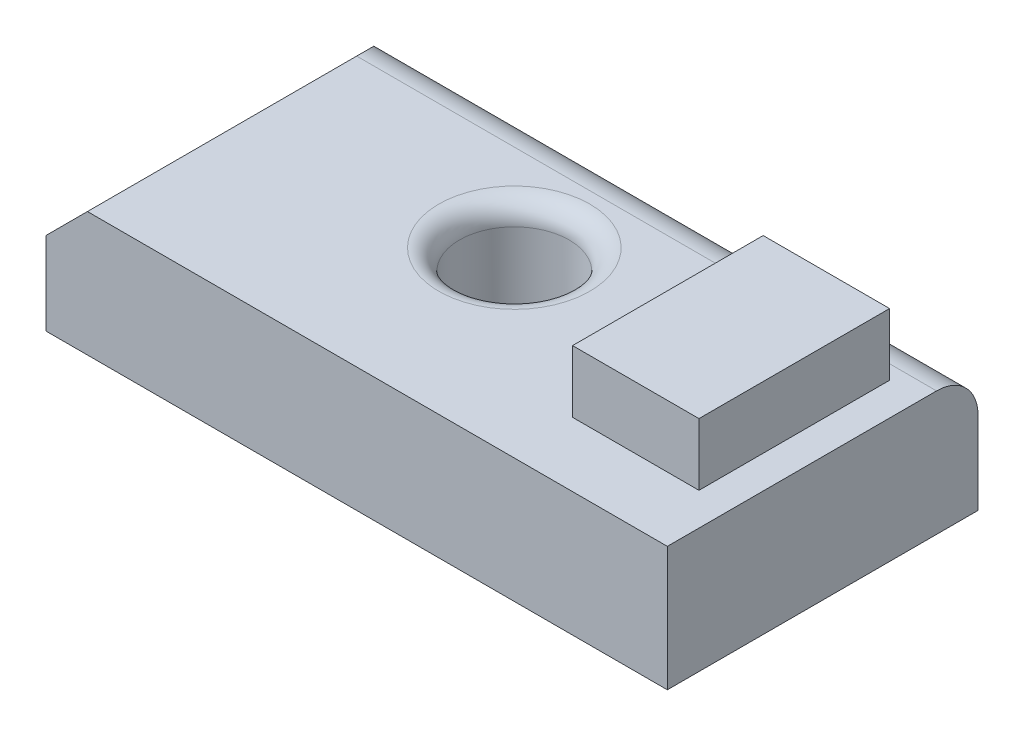
ISO-10303-21;
HEADER;
FILE_DESCRIPTION(('STEP AP214'),'2;1');
FILE_NAME('part.step','',(''),(''),'','','');
FILE_SCHEMA(('AUTOMOTIVE_DESIGN { 1 0 10303 214 1 1 1 1 }'));
ENDSEC;
DATA;
#1=APPLICATION_CONTEXT('core data for automotive mechanical design processes');
#2=APPLICATION_PROTOCOL_DEFINITION('international standard','automotive_design',2000,#1);
#3=PRODUCT_CONTEXT('',#1,'mechanical');
#4=PRODUCT('Part','Part','',(#3));
#5=PRODUCT_RELATED_PRODUCT_CATEGORY('part','',(#4));
#6=PRODUCT_DEFINITION_FORMATION('','',#4);
#7=PRODUCT_DEFINITION_CONTEXT('part definition',#1,'design');
#8=PRODUCT_DEFINITION('design','',#6,#7);
#9=PRODUCT_DEFINITION_SHAPE('','',#8);
#10=(LENGTH_UNIT() NAMED_UNIT(*) SI_UNIT(.MILLI.,.METRE.));
#11=(NAMED_UNIT(*) PLANE_ANGLE_UNIT() SI_UNIT($,.RADIAN.));
#12=(NAMED_UNIT(*) SI_UNIT($,.STERADIAN.) SOLID_ANGLE_UNIT());
#13=UNCERTAINTY_MEASURE_WITH_UNIT(LENGTH_MEASURE(1.E-05),#10,'distance_accuracy_value','');
#14=(GEOMETRIC_REPRESENTATION_CONTEXT(3) GLOBAL_UNCERTAINTY_ASSIGNED_CONTEXT((#13)) GLOBAL_UNIT_ASSIGNED_CONTEXT((#10,
#11,#12)) REPRESENTATION_CONTEXT('',''));
#15=CARTESIAN_POINT('',(0.,0.,0.));
#16=DIRECTION('',(0.,0.,1.));
#17=DIRECTION('',(1.,0.,0.));
#18=AXIS2_PLACEMENT_3D('',#15,#16,#17);
#19=CARTESIAN_POINT('',(0.,762.,0.));
#20=DIRECTION('',(0.,-1.,0.));
#21=DIRECTION('',(0.,0.,-1.));
#22=AXIS2_PLACEMENT_3D('',#19,#20,#21);
#23=PLANE('',#22);
#24=CARTESIAN_POINT('',(1412.46673219988,762.,-339.940416014676));
#25=DIRECTION('',(0.,-1.,0.));
#26=DIRECTION('',(0.,0.,-1.));
#27=AXIS2_PLACEMENT_3D('',#24,#25,#26);
#28=CIRCLE('',#27,463.258211587935);
#29=CARTESIAN_POINT('',(1412.46673219988,762.,-803.198627602611));
#30=VERTEX_POINT('',#29);
#31=EDGE_CURVE('E200',#30,#30,#28,.T.);
#32=ORIENTED_EDGE('',*,*,#31,.T.);
#33=EDGE_LOOP('',(#32));
#34=FACE_BOUND('',#33,.T.);
#35=DIRECTION('',(1.,0.,0.));
#36=VECTOR('',#35,1.);
#37=CARTESIAN_POINT('',(-88.3732718894001,762.,-874.076036866359));
#38=LINE('',#37,#36);
#39=CARTESIAN_POINT('',(3467.6267281106,762.,-874.076036866359));
#40=VERTEX_POINT('',#39);
#41=CARTESIAN_POINT('',(-88.3732718894005,762.,-874.076036866359));
#42=VERTEX_POINT('',#41);
#43=EDGE_CURVE('E221',#40,#42,#38,.F.);
#44=ORIENTED_EDGE('',*,*,#43,.T.);
#45=DIRECTION('',(0.,0.,1.));
#46=VECTOR('',#45,1.);
#47=CARTESIAN_POINT('',(-88.3732718894003,762.,0.));
#48=LINE('',#47,#46);
#49=CARTESIAN_POINT('',(-88.3732718894002,762.,776.923963133641));
#50=VERTEX_POINT('',#49);
#51=EDGE_CURVE('E228',#42,#50,#48,.T.);
#52=ORIENTED_EDGE('',*,*,#51,.T.);
#53=DIRECTION('',(1.,0.,0.));
#54=VECTOR('',#53,1.);
#55=CARTESIAN_POINT('',(-342.373271889401,762.,776.923963133641));
#56=LINE('',#55,#54);
#57=CARTESIAN_POINT('',(3467.6267281106,762.,776.923963133641));
#58=VERTEX_POINT('',#57);
#59=EDGE_CURVE('E165',#50,#58,#56,.T.);
#60=ORIENTED_EDGE('',*,*,#59,.T.);
#61=DIRECTION('',(0.,0.,1.));
#62=VECTOR('',#61,1.);
#63=CARTESIAN_POINT('',(3467.6267281106,762.,-1128.07603686636));
#64=LINE('',#63,#62);
#65=EDGE_CURVE('E168',#40,#58,#64,.T.);
#66=ORIENTED_EDGE('',*,*,#65,.F.);
#67=EDGE_LOOP('',(#44,#52,#60,#66));
#68=FACE_BOUND('',#67,.T.);
#69=DIRECTION('',(0.,0.,1.));
#70=VECTOR('',#69,1.);
#71=CARTESIAN_POINT('',(2491.99555228911,762.,-786.362098171456));
#72=LINE('',#71,#70);
#73=CARTESIAN_POINT('',(2491.99555228911,762.,-786.362098171456));
#74=VERTEX_POINT('',#73);
#75=CARTESIAN_POINT('',(2491.99555228911,762.,382.451095555233));
#76=VERTEX_POINT('',#75);
#77=EDGE_CURVE('E152',#74,#76,#72,.T.);
#78=ORIENTED_EDGE('',*,*,#77,.F.);
#79=DIRECTION('',(-1.,0.,0.));
#80=VECTOR('',#79,1.);
#81=CARTESIAN_POINT('',(2491.99555228911,762.,-786.362098171456));
#82=LINE('',#81,#80);
#83=CARTESIAN_POINT('',(3267.14596896202,762.,-786.362098171456));
#84=VERTEX_POINT('',#83);
#85=EDGE_CURVE('E149',#84,#74,#82,.T.);
#86=ORIENTED_EDGE('',*,*,#85,.F.);
#87=DIRECTION('',(0.,0.,-1.));
#88=VECTOR('',#87,1.);
#89=CARTESIAN_POINT('',(3267.14596896202,762.,-786.362098171456));
#90=LINE('',#89,#88);
#91=CARTESIAN_POINT('',(3267.14596896202,762.,382.451095555233));
#92=VERTEX_POINT('',#91);
#93=EDGE_CURVE('E409',#92,#84,#90,.T.);
#94=ORIENTED_EDGE('',*,*,#93,.F.);
#95=DIRECTION('',(1.,0.,0.));
#96=VECTOR('',#95,1.);
#97=CARTESIAN_POINT('',(2491.99555228911,762.,382.451095555233));
#98=LINE('',#97,#96);
#99=EDGE_CURVE('E419',#76,#92,#98,.T.);
#100=ORIENTED_EDGE('',*,*,#99,.F.);
#101=EDGE_LOOP('',(#78,#86,#94,#100));
#102=FACE_BOUND('',#101,.T.);
#103=ADVANCED_FACE('F42',(#34,#68,#102),#23,.F.);
#104=CARTESIAN_POINT('',(-342.373271889401,762.,776.923963133641));
#105=DIRECTION('',(0.,0.,-1.));
#106=DIRECTION('',(-1.,0.,0.));
#107=AXIS2_PLACEMENT_3D('',#104,#105,#106);
#108=PLANE('',#107);
#109=ORIENTED_EDGE('',*,*,#59,.F.);
#110=DIRECTION('',(0.707106781186546,0.707106781186549,0.));
#111=VECTOR('',#110,1.);
#112=CARTESIAN_POINT('',(-88.3732718894003,762.,776.923963133641));
#113=LINE('',#112,#111);
#114=CARTESIAN_POINT('',(-342.373271889401,507.999999999999,776.923963133641));
#115=VERTEX_POINT('',#114);
#116=EDGE_CURVE('E232',#50,#115,#113,.F.);
#117=ORIENTED_EDGE('',*,*,#116,.T.);
#118=DIRECTION('',(0.,-1.,0.));
#119=VECTOR('',#118,1.);
#120=CARTESIAN_POINT('',(-342.373271889401,762.,776.923963133641));
#121=LINE('',#120,#119);
#122=CARTESIAN_POINT('',(-342.373271889401,0.,776.923963133641));
#123=VERTEX_POINT('',#122);
#124=EDGE_CURVE('E173',#115,#123,#121,.T.);
#125=ORIENTED_EDGE('',*,*,#124,.T.);
#126=DIRECTION('',(1.,0.,0.));
#127=VECTOR('',#126,1.);
#128=CARTESIAN_POINT('',(-342.373271889401,0.,776.923963133641));
#129=LINE('',#128,#127);
#130=CARTESIAN_POINT('',(3467.6267281106,0.,776.923963133641));
#131=VERTEX_POINT('',#130);
#132=EDGE_CURVE('E159',#123,#131,#129,.T.);
#133=ORIENTED_EDGE('',*,*,#132,.T.);
#134=DIRECTION('',(0.,-1.,0.));
#135=VECTOR('',#134,1.);
#136=CARTESIAN_POINT('',(3467.6267281106,762.,776.923963133641));
#137=LINE('',#136,#135);
#138=EDGE_CURVE('E193',#58,#131,#137,.T.);
#139=ORIENTED_EDGE('',*,*,#138,.F.);
#140=EDGE_LOOP('',(#109,#117,#125,#133,#139));
#141=FACE_BOUND('',#140,.T.);
#142=ADVANCED_FACE('F239',(#141),#108,.F.);
#143=CARTESIAN_POINT('',(3467.6267281106,762.,-1128.07603686636));
#144=DIRECTION('',(1.,0.,0.));
#145=DIRECTION('',(0.,0.,-1.));
#146=AXIS2_PLACEMENT_3D('',#143,#144,#145);
#147=PLANE('',#146);
#148=DIRECTION('',(0.,-1.,0.));
#149=VECTOR('',#148,1.);
#150=CARTESIAN_POINT('',(3467.6267281106,762.,-1128.07603686636));
#151=LINE('',#150,#149);
#152=CARTESIAN_POINT('',(3467.6267281106,508.,-1128.07603686636));
#153=VERTEX_POINT('',#152);
#154=CARTESIAN_POINT('',(3467.6267281106,0.,-1128.07603686636));
#155=VERTEX_POINT('',#154);
#156=EDGE_CURVE('E190',#153,#155,#151,.T.);
#157=ORIENTED_EDGE('',*,*,#156,.F.);
#158=CARTESIAN_POINT('',(3467.6267281106,508.,-874.076036866359));
#159=DIRECTION('',(1.,0.,0.));
#160=DIRECTION('',(0.,0.,-1.));
#161=AXIS2_PLACEMENT_3D('',#158,#159,#160);
#162=CIRCLE('',#161,254.);
#163=EDGE_CURVE('E218',#153,#40,#162,.T.);
#164=ORIENTED_EDGE('',*,*,#163,.T.);
#165=ORIENTED_EDGE('',*,*,#65,.T.);
#166=ORIENTED_EDGE('',*,*,#138,.T.);
#167=DIRECTION('',(0.,0.,1.));
#168=VECTOR('',#167,1.);
#169=CARTESIAN_POINT('',(3467.6267281106,0.,-1128.07603686636));
#170=LINE('',#169,#168);
#171=EDGE_CURVE('E177',#155,#131,#170,.T.);
#172=ORIENTED_EDGE('',*,*,#171,.F.);
#173=EDGE_LOOP('',(#157,#164,#165,#166,#172));
#174=FACE_BOUND('',#173,.T.);
#175=ADVANCED_FACE('F256',(#174),#147,.T.);
#176=CARTESIAN_POINT('',(-342.373271889401,762.,-1128.07603686636));
#177=DIRECTION('',(0.,0.,-1.));
#178=DIRECTION('',(-1.,0.,0.));
#179=AXIS2_PLACEMENT_3D('',#176,#177,#178);
#180=PLANE('',#179);
#181=DIRECTION('',(0.,1.,0.));
#182=VECTOR('',#181,1.);
#183=CARTESIAN_POINT('',(-88.3732718894,762.,-1128.07603686636));
#184=LINE('',#183,#182);
#185=CARTESIAN_POINT('',(-88.3732718894001,0.,-1128.07603686636));
#186=VERTEX_POINT('',#185);
#187=CARTESIAN_POINT('',(-88.3732718894,508.,-1128.07603686636));
#188=VERTEX_POINT('',#187);
#189=EDGE_CURVE('E210',#186,#188,#184,.T.);
#190=ORIENTED_EDGE('',*,*,#189,.T.);
#191=DIRECTION('',(1.,0.,0.));
#192=VECTOR('',#191,1.);
#193=CARTESIAN_POINT('',(3467.6267281106,508.,-1128.07603686636));
#194=LINE('',#193,#192);
#195=EDGE_CURVE('E214',#188,#153,#194,.T.);
#196=ORIENTED_EDGE('',*,*,#195,.T.);
#197=ORIENTED_EDGE('',*,*,#156,.T.);
#198=DIRECTION('',(1.,0.,0.));
#199=VECTOR('',#198,1.);
#200=CARTESIAN_POINT('',(-342.373271889401,0.,-1128.07603686636));
#201=LINE('',#200,#199);
#202=EDGE_CURVE('E181',#186,#155,#201,.T.);
#203=ORIENTED_EDGE('',*,*,#202,.F.);
#204=EDGE_LOOP('',(#190,#196,#197,#203));
#205=FACE_BOUND('',#204,.T.);
#206=ADVANCED_FACE('F262',(#205),#180,.T.);
#207=CARTESIAN_POINT('',(-342.373271889401,762.,-1128.07603686636));
#208=DIRECTION('',(1.,0.,0.));
#209=DIRECTION('',(0.,0.,-1.));
#210=AXIS2_PLACEMENT_3D('',#207,#208,#209);
#211=PLANE('',#210);
#212=ORIENTED_EDGE('',*,*,#124,.F.);
#213=DIRECTION('',(0.,0.,-1.));
#214=VECTOR('',#213,1.);
#215=CARTESIAN_POINT('',(-342.373271889401,507.999999999999,-1128.07603686636));
#216=LINE('',#215,#214);
#217=CARTESIAN_POINT('',(-342.373271889401,507.999999999999,-874.076036866359));
#218=VERTEX_POINT('',#217);
#219=EDGE_CURVE('E66',#115,#218,#216,.T.);
#220=ORIENTED_EDGE('',*,*,#219,.T.);
#221=DIRECTION('',(0.,-1.,0.));
#222=VECTOR('',#221,1.);
#223=CARTESIAN_POINT('',(-342.373271889401,0.,-874.076036866359));
#224=LINE('',#223,#222);
#225=CARTESIAN_POINT('',(-342.373271889401,0.,-874.076036866359));
#226=VERTEX_POINT('',#225);
#227=EDGE_CURVE('E204',#218,#226,#224,.T.);
#228=ORIENTED_EDGE('',*,*,#227,.T.);
#229=DIRECTION('',(0.,0.,1.));
#230=VECTOR('',#229,1.);
#231=CARTESIAN_POINT('',(-342.373271889401,0.,-1128.07603686636));
#232=LINE('',#231,#230);
#233=EDGE_CURVE('E169',#226,#123,#232,.T.);
#234=ORIENTED_EDGE('',*,*,#233,.T.);
#235=EDGE_LOOP('',(#212,#220,#228,#234));
#236=FACE_BOUND('',#235,.T.);
#237=ADVANCED_FACE('F243',(#236),#211,.F.);
#238=CARTESIAN_POINT('',(0.,0.,0.));
#239=DIRECTION('',(0.,-1.,0.));
#240=DIRECTION('',(0.,0.,-1.));
#241=AXIS2_PLACEMENT_3D('',#238,#239,#240);
#242=PLANE('',#241);
#243=CARTESIAN_POINT('',(1412.46673219988,0.,-339.940416014676));
#244=DIRECTION('',(0.,1.,0.));
#245=DIRECTION('',(0.,0.,1.));
#246=AXIS2_PLACEMENT_3D('',#243,#244,#245);
#247=CIRCLE('',#246,336.258211587935);
#248=CARTESIAN_POINT('',(1412.46673219988,0.,-3.68220442674011));
#249=VERTEX_POINT('',#248);
#250=EDGE_CURVE('E154',#249,#249,#247,.T.);
#251=ORIENTED_EDGE('',*,*,#250,.T.);
#252=EDGE_LOOP('',(#251));
#253=FACE_BOUND('',#252,.T.);
#254=ORIENTED_EDGE('',*,*,#233,.F.);
#255=DIRECTION('',(0.707106781186549,0.,-0.707106781186546));
#256=VECTOR('',#255,1.);
#257=CARTESIAN_POINT('',(-608.22465437788,0.,-608.224654377882));
#258=LINE('',#257,#256);
#259=EDGE_CURVE('E207',#226,#186,#258,.T.);
#260=ORIENTED_EDGE('',*,*,#259,.T.);
#261=ORIENTED_EDGE('',*,*,#202,.T.);
#262=ORIENTED_EDGE('',*,*,#171,.T.);
#263=ORIENTED_EDGE('',*,*,#132,.F.);
#264=EDGE_LOOP('',(#254,#260,#261,#262,#263));
#265=FACE_BOUND('',#264,.T.);
#266=ADVANCED_FACE('F259',(#253,#265),#242,.T.);
#267=CARTESIAN_POINT('',(1412.46673219988,0.,-339.940416014676));
#268=DIRECTION('',(0.,1.,0.));
#269=DIRECTION('',(0.,0.,1.));
#270=AXIS2_PLACEMENT_3D('',#267,#268,#269);
#271=CYLINDRICAL_SURFACE('',#270,336.258211587935);
#272=CARTESIAN_POINT('',(1412.46673219988,635.,-339.940416014676));
#273=DIRECTION('',(0.,-1.,0.));
#274=DIRECTION('',(0.,0.,-1.));
#275=AXIS2_PLACEMENT_3D('',#272,#273,#274);
#276=CIRCLE('',#275,336.258211587935);
#277=CARTESIAN_POINT('',(1412.46673219988,635.,-676.198627602611));
#278=VERTEX_POINT('',#277);
#279=EDGE_CURVE('E196',#278,#278,#276,.F.);
#280=ORIENTED_EDGE('',*,*,#279,.T.);
#281=EDGE_LOOP('',(#280));
#282=FACE_BOUND('',#281,.T.);
#283=ORIENTED_EDGE('',*,*,#250,.F.);
#284=EDGE_LOOP('',(#283));
#285=FACE_BOUND('',#284,.T.);
#286=ADVANCED_FACE('F286',(#282,#285),#271,.F.);
#287=CARTESIAN_POINT('',(2491.99555228911,1143.,-786.362098171456));
#288=DIRECTION('',(1.,0.,0.));
#289=DIRECTION('',(0.,0.,-1.));
#290=AXIS2_PLACEMENT_3D('',#287,#288,#289);
#291=PLANE('',#290);
#292=ORIENTED_EDGE('',*,*,#77,.T.);
#293=DIRECTION('',(0.,-1.,0.));
#294=VECTOR('',#293,1.);
#295=CARTESIAN_POINT('',(2491.99555228911,1143.,382.451095555233));
#296=LINE('',#295,#294);
#297=CARTESIAN_POINT('',(2491.99555228911,1143.,382.451095555233));
#298=VERTEX_POINT('',#297);
#299=EDGE_CURVE('E131',#298,#76,#296,.T.);
#300=ORIENTED_EDGE('',*,*,#299,.F.);
#301=DIRECTION('',(0.,0.,1.));
#302=VECTOR('',#301,1.);
#303=CARTESIAN_POINT('',(2491.99555228911,1143.,-786.362098171456));
#304=LINE('',#303,#302);
#305=CARTESIAN_POINT('',(2491.99555228911,1143.,-786.362098171456));
#306=VERTEX_POINT('',#305);
#307=EDGE_CURVE('E139',#306,#298,#304,.T.);
#308=ORIENTED_EDGE('',*,*,#307,.F.);
#309=DIRECTION('',(0.,-1.,0.));
#310=VECTOR('',#309,1.);
#311=CARTESIAN_POINT('',(2491.99555228911,1143.,-786.362098171456));
#312=LINE('',#311,#310);
#313=EDGE_CURVE('E405',#306,#74,#312,.T.);
#314=ORIENTED_EDGE('',*,*,#313,.T.);
#315=EDGE_LOOP('',(#292,#300,#308,#314));
#316=FACE_BOUND('',#315,.T.);
#317=ADVANCED_FACE('F151',(#316),#291,.F.);
#318=CARTESIAN_POINT('',(2491.99555228911,1143.,382.451095555233));
#319=DIRECTION('',(0.,0.,-1.));
#320=DIRECTION('',(-1.,0.,0.));
#321=AXIS2_PLACEMENT_3D('',#318,#319,#320);
#322=PLANE('',#321);
#323=ORIENTED_EDGE('',*,*,#99,.T.);
#324=DIRECTION('',(0.,-1.,0.));
#325=VECTOR('',#324,1.);
#326=CARTESIAN_POINT('',(3267.14596896202,1143.,382.451095555233));
#327=LINE('',#326,#325);
#328=CARTESIAN_POINT('',(3267.14596896202,1143.,382.451095555233));
#329=VERTEX_POINT('',#328);
#330=EDGE_CURVE('E134',#329,#92,#327,.T.);
#331=ORIENTED_EDGE('',*,*,#330,.F.);
#332=DIRECTION('',(1.,0.,0.));
#333=VECTOR('',#332,1.);
#334=CARTESIAN_POINT('',(2491.99555228911,1143.,382.451095555233));
#335=LINE('',#334,#333);
#336=EDGE_CURVE('E126',#298,#329,#335,.T.);
#337=ORIENTED_EDGE('',*,*,#336,.F.);
#338=ORIENTED_EDGE('',*,*,#299,.T.);
#339=EDGE_LOOP('',(#323,#331,#337,#338));
#340=FACE_BOUND('',#339,.T.);
#341=ADVANCED_FACE('F129',(#340),#322,.F.);
#342=CARTESIAN_POINT('',(3267.14596896202,1143.,-786.362098171456));
#343=DIRECTION('',(-1.,0.,0.));
#344=DIRECTION('',(0.,0.,1.));
#345=AXIS2_PLACEMENT_3D('',#342,#343,#344);
#346=PLANE('',#345);
#347=ORIENTED_EDGE('',*,*,#93,.T.);
#348=DIRECTION('',(0.,-1.,0.));
#349=VECTOR('',#348,1.);
#350=CARTESIAN_POINT('',(3267.14596896202,1143.,-786.362098171456));
#351=LINE('',#350,#349);
#352=CARTESIAN_POINT('',(3267.14596896202,1143.,-786.362098171456));
#353=VERTEX_POINT('',#352);
#354=EDGE_CURVE('E161',#353,#84,#351,.T.);
#355=ORIENTED_EDGE('',*,*,#354,.F.);
#356=DIRECTION('',(0.,0.,-1.));
#357=VECTOR('',#356,1.);
#358=CARTESIAN_POINT('',(3267.14596896202,1143.,-786.362098171456));
#359=LINE('',#358,#357);
#360=EDGE_CURVE('E138',#329,#353,#359,.T.);
#361=ORIENTED_EDGE('',*,*,#360,.F.);
#362=ORIENTED_EDGE('',*,*,#330,.T.);
#363=EDGE_LOOP('',(#347,#355,#361,#362));
#364=FACE_BOUND('',#363,.T.);
#365=ADVANCED_FACE('F338',(#364),#346,.F.);
#366=CARTESIAN_POINT('',(2491.99555228911,1143.,-786.362098171456));
#367=DIRECTION('',(0.,0.,1.));
#368=DIRECTION('',(1.,0.,0.));
#369=AXIS2_PLACEMENT_3D('',#366,#367,#368);
#370=PLANE('',#369);
#371=ORIENTED_EDGE('',*,*,#85,.T.);
#372=ORIENTED_EDGE('',*,*,#313,.F.);
#373=DIRECTION('',(-1.,0.,0.));
#374=VECTOR('',#373,1.);
#375=CARTESIAN_POINT('',(2491.99555228911,1143.,-786.362098171456));
#376=LINE('',#375,#374);
#377=EDGE_CURVE('E144',#353,#306,#376,.T.);
#378=ORIENTED_EDGE('',*,*,#377,.F.);
#379=ORIENTED_EDGE('',*,*,#354,.T.);
#380=EDGE_LOOP('',(#371,#372,#378,#379));
#381=FACE_BOUND('',#380,.T.);
#382=ADVANCED_FACE('F345',(#381),#370,.F.);
#383=CARTESIAN_POINT('',(0.,1143.,0.));
#384=DIRECTION('',(0.,1.,0.));
#385=DIRECTION('',(0.,0.,1.));
#386=AXIS2_PLACEMENT_3D('',#383,#384,#385);
#387=PLANE('',#386);
#388=ORIENTED_EDGE('',*,*,#307,.T.);
#389=ORIENTED_EDGE('',*,*,#336,.T.);
#390=ORIENTED_EDGE('',*,*,#360,.T.);
#391=ORIENTED_EDGE('',*,*,#377,.T.);
#392=EDGE_LOOP('',(#388,#389,#390,#391));
#393=FACE_BOUND('',#392,.T.);
#394=ADVANCED_FACE('F142',(#393),#387,.T.);
#395=CARTESIAN_POINT('',(1412.46673219988,635.,-339.940416014676));
#396=DIRECTION('',(0.,-1.,0.));
#397=DIRECTION('',(0.,0.,-1.));
#398=AXIS2_PLACEMENT_3D('',#395,#396,#397);
#399=TOROIDAL_SURFACE('',#398,463.258211587935,127.);
#400=ORIENTED_EDGE('',*,*,#31,.F.);
#401=EDGE_LOOP('',(#400));
#402=FACE_BOUND('',#401,.T.);
#403=ORIENTED_EDGE('',*,*,#279,.F.);
#404=EDGE_LOOP('',(#403));
#405=FACE_BOUND('',#404,.T.);
#406=ADVANCED_FACE('F267',(#402,#405),#399,.T.);
#407=CARTESIAN_POINT('',(-342.373271889401,762.,-874.076036866359));
#408=DIRECTION('',(-0.707106781186546,0.,-0.707106781186549));
#409=DIRECTION('',(0.,1.,0.));
#410=AXIS2_PLACEMENT_3D('',#407,#408,#409);
#411=PLANE('',#410);
#412=ORIENTED_EDGE('',*,*,#227,.F.);
#413=DIRECTION('',(-0.577350269189626,-0.577350269189628,0.577350269189624));
#414=VECTOR('',#413,1.);
#415=CARTESIAN_POINT('',(-257.706605222734,592.666666666666,-958.742703533027));
#416=LINE('',#415,#414);
#417=CARTESIAN_POINT('',(-162.768149468017,687.605122421383,-1053.68115928774));
#418=VERTEX_POINT('',#417);
#419=EDGE_CURVE('E52',#218,#418,#416,.F.);
#420=ORIENTED_EDGE('',*,*,#419,.T.);
#421=CARTESIAN_POINT('',(-342.373271889401,508.,-874.076036866359));
#422=DIRECTION('',(-0.707106781186546,0.,-0.707106781186549));
#423=DIRECTION('',(-0.707106781186549,0.,0.707106781186546));
#424=AXIS2_PLACEMENT_3D('',#421,#422,#423);
#425=ELLIPSE('',#424,359.210244842767,254.);
#426=EDGE_CURVE('E225',#418,#188,#425,.T.);
#427=ORIENTED_EDGE('',*,*,#426,.T.);
#428=ORIENTED_EDGE('',*,*,#189,.F.);
#429=ORIENTED_EDGE('',*,*,#259,.F.);
#430=EDGE_LOOP('',(#412,#420,#427,#428,#429));
#431=FACE_BOUND('',#430,.T.);
#432=ADVANCED_FACE('F265',(#431),#411,.T.);
#433=CARTESIAN_POINT('',(-342.373271889401,508.,-874.076036866359));
#434=DIRECTION('',(-1.,0.,0.));
#435=DIRECTION('',(0.,0.,1.));
#436=AXIS2_PLACEMENT_3D('',#433,#434,#435);
#437=CYLINDRICAL_SURFACE('',#436,254.);
#438=ORIENTED_EDGE('',*,*,#426,.F.);
#439=CARTESIAN_POINT('',(-342.3732718894,508.,-874.076036866359));
#440=DIRECTION('',(0.707106781186549,-0.707106781186546,0.));
#441=DIRECTION('',(-0.707106781186546,-0.707106781186549,0.));
#442=AXIS2_PLACEMENT_3D('',#439,#440,#441);
#443=ELLIPSE('',#442,359.210244842765,254.);
#444=EDGE_CURVE('E11',#418,#42,#443,.T.);
#445=ORIENTED_EDGE('',*,*,#444,.T.);
#446=ORIENTED_EDGE('',*,*,#43,.F.);
#447=ORIENTED_EDGE('',*,*,#163,.F.);
#448=ORIENTED_EDGE('',*,*,#195,.F.);
#449=EDGE_LOOP('',(#438,#445,#446,#447,#448));
#450=FACE_BOUND('',#449,.T.);
#451=ADVANCED_FACE('F249',(#450),#437,.T.);
#452=CARTESIAN_POINT('',(-88.3732718894003,762.,0.));
#453=DIRECTION('',(0.707106781186549,-0.707106781186546,0.));
#454=DIRECTION('',(0.,0.,1.));
#455=AXIS2_PLACEMENT_3D('',#452,#453,#454);
#456=PLANE('',#455);
#457=ORIENTED_EDGE('',*,*,#419,.F.);
#458=ORIENTED_EDGE('',*,*,#219,.F.);
#459=ORIENTED_EDGE('',*,*,#116,.F.);
#460=ORIENTED_EDGE('',*,*,#51,.F.);
#461=ORIENTED_EDGE('',*,*,#444,.F.);
#462=EDGE_LOOP('',(#457,#458,#459,#460,#461));
#463=FACE_BOUND('',#462,.T.);
#464=ADVANCED_FACE('F45',(#463),#456,.F.);
#465=CLOSED_SHELL('',(#103,#142,#175,#206,#237,#266,#286,#317,#341,#365,#382,#394,#406,#432,
#451,#464));
#466=MANIFOLD_SOLID_BREP('B2',#465);
#467=ADVANCED_BREP_SHAPE_REPRESENTATION('',(#18,#466),#14);
#468=SHAPE_DEFINITION_REPRESENTATION(#9,#467);
ENDSEC;
END-ISO-10303-21;
